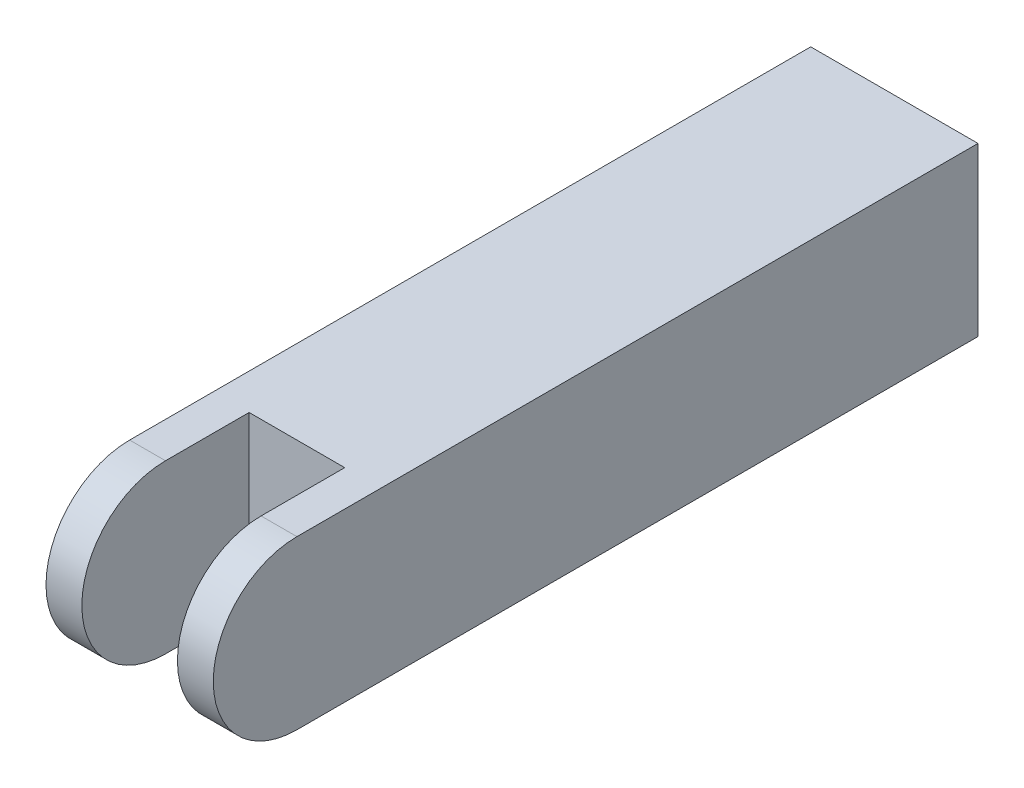
ISO-10303-21;
HEADER;
FILE_DESCRIPTION(('STEP AP214'),'2;1');
FILE_NAME('part.step','',(''),(''),'','','');
FILE_SCHEMA(('AUTOMOTIVE_DESIGN { 1 0 10303 214 1 1 1 1 }'));
ENDSEC;
DATA;
#1=APPLICATION_CONTEXT('core data for automotive mechanical design processes');
#2=APPLICATION_PROTOCOL_DEFINITION('international standard','automotive_design',2000,#1);
#3=PRODUCT_CONTEXT('',#1,'mechanical');
#4=PRODUCT('Part','Part','',(#3));
#5=PRODUCT_RELATED_PRODUCT_CATEGORY('part','',(#4));
#6=PRODUCT_DEFINITION_FORMATION('','',#4);
#7=PRODUCT_DEFINITION_CONTEXT('part definition',#1,'design');
#8=PRODUCT_DEFINITION('design','',#6,#7);
#9=PRODUCT_DEFINITION_SHAPE('','',#8);
#10=(LENGTH_UNIT() NAMED_UNIT(*) SI_UNIT(.MILLI.,.METRE.));
#11=(NAMED_UNIT(*) PLANE_ANGLE_UNIT() SI_UNIT($,.RADIAN.));
#12=(NAMED_UNIT(*) SI_UNIT($,.STERADIAN.) SOLID_ANGLE_UNIT());
#13=UNCERTAINTY_MEASURE_WITH_UNIT(LENGTH_MEASURE(1.E-05),#10,'distance_accuracy_value','');
#14=(GEOMETRIC_REPRESENTATION_CONTEXT(3) GLOBAL_UNCERTAINTY_ASSIGNED_CONTEXT((#13)) GLOBAL_UNIT_ASSIGNED_CONTEXT((#10,
#11,#12)) REPRESENTATION_CONTEXT('',''));
#15=CARTESIAN_POINT('',(0.,0.,0.));
#16=DIRECTION('',(0.,0.,1.));
#17=DIRECTION('',(1.,0.,0.));
#18=AXIS2_PLACEMENT_3D('',#15,#16,#17);
#19=CARTESIAN_POINT('',(-57.,0.,57.));
#20=DIRECTION('',(1.,0.,0.));
#21=DIRECTION('',(0.,1.,0.));
#22=AXIS2_PLACEMENT_3D('',#19,#20,#21);
#23=CYLINDRICAL_SURFACE('',#22,7.);
#24=CARTESIAN_POINT('',(-4.,0.,57.));
#25=DIRECTION('',(-1.,0.,0.));
#26=DIRECTION('',(0.,0.,1.));
#27=AXIS2_PLACEMENT_3D('',#24,#25,#26);
#28=CIRCLE('',#27,7.);
#29=CARTESIAN_POINT('',(-4.,-7.,57.));
#30=VERTEX_POINT('',#29);
#31=CARTESIAN_POINT('',(-4.,7.,57.));
#32=VERTEX_POINT('',#31);
#33=EDGE_CURVE('E11',#30,#32,#28,.T.);
#34=ORIENTED_EDGE('',*,*,#33,.T.);
#35=DIRECTION('',(1.,0.,0.));
#36=VECTOR('',#35,1.);
#37=CARTESIAN_POINT('',(-57.,6.99999999999998,57.));
#38=LINE('',#37,#36);
#39=CARTESIAN_POINT('',(-7.,7.,57.));
#40=VERTEX_POINT('',#39);
#41=EDGE_CURVE('E138',#40,#32,#38,.T.);
#42=ORIENTED_EDGE('',*,*,#41,.F.);
#43=CARTESIAN_POINT('',(-7.,0.,57.));
#44=DIRECTION('',(1.,0.,0.));
#45=DIRECTION('',(0.,1.,0.));
#46=AXIS2_PLACEMENT_3D('',#43,#44,#45);
#47=CIRCLE('',#46,7.);
#48=CARTESIAN_POINT('',(-7.,-7.,57.));
#49=VERTEX_POINT('',#48);
#50=EDGE_CURVE('E137',#49,#40,#47,.F.);
#51=ORIENTED_EDGE('',*,*,#50,.F.);
#52=DIRECTION('',(1.,0.,0.));
#53=VECTOR('',#52,1.);
#54=CARTESIAN_POINT('',(-57.,-7.00000000000002,57.));
#55=LINE('',#54,#53);
#56=EDGE_CURVE('E134',#49,#30,#55,.T.);
#57=ORIENTED_EDGE('',*,*,#56,.T.);
#58=EDGE_LOOP('',(#34,#42,#51,#57));
#59=FACE_BOUND('',#58,.T.);
#60=ADVANCED_FACE('F38',(#59),#23,.T.);
#61=CARTESIAN_POINT('',(-7.,7.,64.));
#62=DIRECTION('',(0.,-1.,0.));
#63=DIRECTION('',(0.,0.,-1.));
#64=AXIS2_PLACEMENT_3D('',#61,#62,#63);
#65=PLANE('',#64);
#66=ORIENTED_EDGE('',*,*,#41,.T.);
#67=DIRECTION('',(0.,0.,1.));
#68=VECTOR('',#67,1.);
#69=CARTESIAN_POINT('',(-4.,7.,64.));
#70=LINE('',#69,#68);
#71=CARTESIAN_POINT('',(-4.,7.,50.));
#72=VERTEX_POINT('',#71);
#73=EDGE_CURVE('E126',#72,#32,#70,.T.);
#74=ORIENTED_EDGE('',*,*,#73,.F.);
#75=DIRECTION('',(-1.,0.,0.));
#76=VECTOR('',#75,1.);
#77=CARTESIAN_POINT('',(-4.,7.,50.));
#78=LINE('',#77,#76);
#79=CARTESIAN_POINT('',(4.,7.,50.));
#80=VERTEX_POINT('',#79);
#81=EDGE_CURVE('E123',#80,#72,#78,.T.);
#82=ORIENTED_EDGE('',*,*,#81,.F.);
#83=DIRECTION('',(0.,0.,-1.));
#84=VECTOR('',#83,1.);
#85=CARTESIAN_POINT('',(4.,7.,64.));
#86=LINE('',#85,#84);
#87=CARTESIAN_POINT('',(4.,7.,57.));
#88=VERTEX_POINT('',#87);
#89=EDGE_CURVE('E104',#88,#80,#86,.T.);
#90=ORIENTED_EDGE('',*,*,#89,.F.);
#91=CARTESIAN_POINT('',(7.,7.,57.));
#92=VERTEX_POINT('',#91);
#93=EDGE_CURVE('E61',#88,#92,#38,.T.);
#94=ORIENTED_EDGE('',*,*,#93,.T.);
#95=DIRECTION('',(0.,0.,-1.));
#96=VECTOR('',#95,1.);
#97=CARTESIAN_POINT('',(7.,7.,64.));
#98=LINE('',#97,#96);
#99=CARTESIAN_POINT('',(7.,7.,0.));
#100=VERTEX_POINT('',#99);
#101=EDGE_CURVE('E156',#92,#100,#98,.T.);
#102=ORIENTED_EDGE('',*,*,#101,.T.);
#103=DIRECTION('',(-1.,0.,0.));
#104=VECTOR('',#103,1.);
#105=CARTESIAN_POINT('',(-7.,7.,0.));
#106=LINE('',#105,#104);
#107=CARTESIAN_POINT('',(-7.,7.,0.));
#108=VERTEX_POINT('',#107);
#109=EDGE_CURVE('E151',#100,#108,#106,.T.);
#110=ORIENTED_EDGE('',*,*,#109,.T.);
#111=DIRECTION('',(0.,0.,-1.));
#112=VECTOR('',#111,1.);
#113=CARTESIAN_POINT('',(-7.,7.,64.));
#114=LINE('',#113,#112);
#115=EDGE_CURVE('E154',#40,#108,#114,.T.);
#116=ORIENTED_EDGE('',*,*,#115,.F.);
#117=EDGE_LOOP('',(#66,#74,#82,#90,#94,#102,#110,#116));
#118=FACE_BOUND('',#117,.T.);
#119=ADVANCED_FACE('F164',(#118),#65,.F.);
#120=CARTESIAN_POINT('',(-7.,7.,64.));
#121=DIRECTION('',(1.,0.,0.));
#122=DIRECTION('',(0.,1.,0.));
#123=AXIS2_PLACEMENT_3D('',#120,#121,#122);
#124=PLANE('',#123);
#125=DIRECTION('',(0.,0.,-1.));
#126=VECTOR('',#125,1.);
#127=CARTESIAN_POINT('',(-7.,-7.,64.));
#128=LINE('',#127,#126);
#129=CARTESIAN_POINT('',(-7.,-7.,0.));
#130=VERTEX_POINT('',#129);
#131=EDGE_CURVE('E160',#49,#130,#128,.T.);
#132=ORIENTED_EDGE('',*,*,#131,.F.);
#133=ORIENTED_EDGE('',*,*,#50,.T.);
#134=ORIENTED_EDGE('',*,*,#115,.T.);
#135=DIRECTION('',(0.,-1.,0.));
#136=VECTOR('',#135,1.);
#137=CARTESIAN_POINT('',(-7.,7.,0.));
#138=LINE('',#137,#136);
#139=EDGE_CURVE('E142',#108,#130,#138,.T.);
#140=ORIENTED_EDGE('',*,*,#139,.T.);
#141=EDGE_LOOP('',(#132,#133,#134,#140));
#142=FACE_BOUND('',#141,.T.);
#143=ADVANCED_FACE('F40',(#142),#124,.F.);
#144=CARTESIAN_POINT('',(-7.,-7.,64.));
#145=DIRECTION('',(0.,1.,0.));
#146=DIRECTION('',(0.,0.,1.));
#147=AXIS2_PLACEMENT_3D('',#144,#145,#146);
#148=PLANE('',#147);
#149=DIRECTION('',(-1.,0.,0.));
#150=VECTOR('',#149,1.);
#151=CARTESIAN_POINT('',(-4.,-7.,50.));
#152=LINE('',#151,#150);
#153=CARTESIAN_POINT('',(4.,-7.,50.));
#154=VERTEX_POINT('',#153);
#155=CARTESIAN_POINT('',(-4.,-7.,50.));
#156=VERTEX_POINT('',#155);
#157=EDGE_CURVE('E109',#154,#156,#152,.T.);
#158=ORIENTED_EDGE('',*,*,#157,.T.);
#159=DIRECTION('',(0.,0.,1.));
#160=VECTOR('',#159,1.);
#161=CARTESIAN_POINT('',(-4.,-7.,64.));
#162=LINE('',#161,#160);
#163=EDGE_CURVE('E121',#156,#30,#162,.T.);
#164=ORIENTED_EDGE('',*,*,#163,.T.);
#165=ORIENTED_EDGE('',*,*,#56,.F.);
#166=ORIENTED_EDGE('',*,*,#131,.T.);
#167=DIRECTION('',(1.,0.,0.));
#168=VECTOR('',#167,1.);
#169=CARTESIAN_POINT('',(-7.,-7.,0.));
#170=LINE('',#169,#168);
#171=CARTESIAN_POINT('',(7.,-7.,0.));
#172=VERTEX_POINT('',#171);
#173=EDGE_CURVE('E145',#130,#172,#170,.T.);
#174=ORIENTED_EDGE('',*,*,#173,.T.);
#175=DIRECTION('',(0.,0.,-1.));
#176=VECTOR('',#175,1.);
#177=CARTESIAN_POINT('',(7.,-7.,64.));
#178=LINE('',#177,#176);
#179=CARTESIAN_POINT('',(7.,-7.,57.));
#180=VERTEX_POINT('',#179);
#181=EDGE_CURVE('E158',#180,#172,#178,.T.);
#182=ORIENTED_EDGE('',*,*,#181,.F.);
#183=CARTESIAN_POINT('',(4.,-7.,57.));
#184=VERTEX_POINT('',#183);
#185=EDGE_CURVE('E120',#184,#180,#55,.T.);
#186=ORIENTED_EDGE('',*,*,#185,.F.);
#187=DIRECTION('',(0.,0.,-1.));
#188=VECTOR('',#187,1.);
#189=CARTESIAN_POINT('',(4.,-7.,64.));
#190=LINE('',#189,#188);
#191=EDGE_CURVE('E53',#184,#154,#190,.T.);
#192=ORIENTED_EDGE('',*,*,#191,.T.);
#193=EDGE_LOOP('',(#158,#164,#165,#166,#174,#182,#186,#192));
#194=FACE_BOUND('',#193,.T.);
#195=ADVANCED_FACE('F118',(#194),#148,.F.);
#196=CARTESIAN_POINT('',(7.,7.,64.));
#197=DIRECTION('',(-1.,0.,0.));
#198=DIRECTION('',(0.,-1.,0.));
#199=AXIS2_PLACEMENT_3D('',#196,#197,#198);
#200=PLANE('',#199);
#201=ORIENTED_EDGE('',*,*,#101,.F.);
#202=CARTESIAN_POINT('',(7.,0.,57.));
#203=DIRECTION('',(-1.,0.,0.));
#204=DIRECTION('',(0.,1.,0.));
#205=AXIS2_PLACEMENT_3D('',#202,#203,#204);
#206=CIRCLE('',#205,7.);
#207=EDGE_CURVE('E131',#180,#92,#206,.T.);
#208=ORIENTED_EDGE('',*,*,#207,.F.);
#209=ORIENTED_EDGE('',*,*,#181,.T.);
#210=DIRECTION('',(0.,1.,0.));
#211=VECTOR('',#210,1.);
#212=CARTESIAN_POINT('',(7.,7.,0.));
#213=LINE('',#212,#211);
#214=EDGE_CURVE('E148',#172,#100,#213,.T.);
#215=ORIENTED_EDGE('',*,*,#214,.T.);
#216=EDGE_LOOP('',(#201,#208,#209,#215));
#217=FACE_BOUND('',#216,.T.);
#218=ADVANCED_FACE('F182',(#217),#200,.F.);
#219=CARTESIAN_POINT('',(0.,0.,0.));
#220=DIRECTION('',(0.,0.,1.));
#221=DIRECTION('',(1.,0.,0.));
#222=AXIS2_PLACEMENT_3D('',#219,#220,#221);
#223=PLANE('',#222);
#224=ORIENTED_EDGE('',*,*,#139,.F.);
#225=ORIENTED_EDGE('',*,*,#109,.F.);
#226=ORIENTED_EDGE('',*,*,#214,.F.);
#227=ORIENTED_EDGE('',*,*,#173,.F.);
#228=EDGE_LOOP('',(#224,#225,#226,#227));
#229=FACE_BOUND('',#228,.T.);
#230=ADVANCED_FACE('F178',(#229),#223,.F.);
#231=ORIENTED_EDGE('',*,*,#93,.F.);
#232=CARTESIAN_POINT('',(4.,0.,57.));
#233=DIRECTION('',(1.,0.,0.));
#234=DIRECTION('',(0.,0.,-1.));
#235=AXIS2_PLACEMENT_3D('',#232,#233,#234);
#236=CIRCLE('',#235,7.);
#237=EDGE_CURVE('E46',#88,#184,#236,.T.);
#238=ORIENTED_EDGE('',*,*,#237,.T.);
#239=ORIENTED_EDGE('',*,*,#185,.T.);
#240=ORIENTED_EDGE('',*,*,#207,.T.);
#241=EDGE_LOOP('',(#231,#238,#239,#240));
#242=FACE_BOUND('',#241,.T.);
#243=ADVANCED_FACE('F162',(#242),#23,.T.);
#244=CARTESIAN_POINT('',(-4.,-7.,64.));
#245=DIRECTION('',(-1.,0.,0.));
#246=DIRECTION('',(0.,0.,1.));
#247=AXIS2_PLACEMENT_3D('',#244,#245,#246);
#248=PLANE('',#247);
#249=ORIENTED_EDGE('',*,*,#33,.F.);
#250=ORIENTED_EDGE('',*,*,#163,.F.);
#251=DIRECTION('',(0.,1.,0.));
#252=VECTOR('',#251,1.);
#253=CARTESIAN_POINT('',(-4.,-7.,50.));
#254=LINE('',#253,#252);
#255=EDGE_CURVE('E108',#156,#72,#254,.T.);
#256=ORIENTED_EDGE('',*,*,#255,.T.);
#257=ORIENTED_EDGE('',*,*,#73,.T.);
#258=EDGE_LOOP('',(#249,#250,#256,#257));
#259=FACE_BOUND('',#258,.T.);
#260=ADVANCED_FACE('F169',(#259),#248,.F.);
#261=CARTESIAN_POINT('',(4.,-7.,64.));
#262=DIRECTION('',(1.,0.,0.));
#263=DIRECTION('',(0.,0.,-1.));
#264=AXIS2_PLACEMENT_3D('',#261,#262,#263);
#265=PLANE('',#264);
#266=ORIENTED_EDGE('',*,*,#89,.T.);
#267=DIRECTION('',(0.,1.,0.));
#268=VECTOR('',#267,1.);
#269=CARTESIAN_POINT('',(4.,-7.,50.));
#270=LINE('',#269,#268);
#271=EDGE_CURVE('E101',#154,#80,#270,.T.);
#272=ORIENTED_EDGE('',*,*,#271,.F.);
#273=ORIENTED_EDGE('',*,*,#191,.F.);
#274=ORIENTED_EDGE('',*,*,#237,.F.);
#275=EDGE_LOOP('',(#266,#272,#273,#274));
#276=FACE_BOUND('',#275,.T.);
#277=ADVANCED_FACE('F103',(#276),#265,.F.);
#278=CARTESIAN_POINT('',(-4.,-7.,50.));
#279=DIRECTION('',(0.,0.,-1.));
#280=DIRECTION('',(-1.,0.,0.));
#281=AXIS2_PLACEMENT_3D('',#278,#279,#280);
#282=PLANE('',#281);
#283=ORIENTED_EDGE('',*,*,#81,.T.);
#284=ORIENTED_EDGE('',*,*,#255,.F.);
#285=ORIENTED_EDGE('',*,*,#157,.F.);
#286=ORIENTED_EDGE('',*,*,#271,.T.);
#287=EDGE_LOOP('',(#283,#284,#285,#286));
#288=FACE_BOUND('',#287,.T.);
#289=ADVANCED_FACE('F112',(#288),#282,.F.);
#290=CLOSED_SHELL('',(#60,#119,#143,#195,#218,#230,#243,#260,#277,#289));
#291=MANIFOLD_SOLID_BREP('B2',#290);
#292=ADVANCED_BREP_SHAPE_REPRESENTATION('',(#18,#291),#14);
#293=SHAPE_DEFINITION_REPRESENTATION(#9,#292);
ENDSEC;
END-ISO-10303-21;
